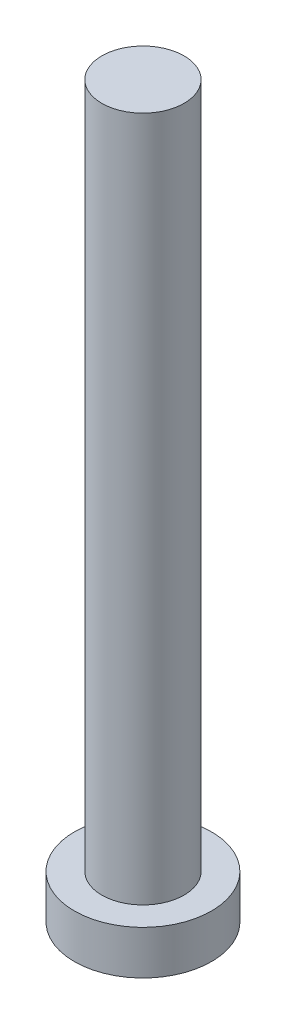
ISO-10303-21;
HEADER;
FILE_DESCRIPTION(('STEP AP214'),'2;1');
FILE_NAME('part.step','',(''),(''),'','','');
FILE_SCHEMA(('AUTOMOTIVE_DESIGN { 1 0 10303 214 1 1 1 1 }'));
ENDSEC;
DATA;
#1=APPLICATION_CONTEXT('core data for automotive mechanical design processes');
#2=APPLICATION_PROTOCOL_DEFINITION('international standard','automotive_design',2000,#1);
#3=PRODUCT_CONTEXT('',#1,'mechanical');
#4=PRODUCT('Part','Part','',(#3));
#5=PRODUCT_RELATED_PRODUCT_CATEGORY('part','',(#4));
#6=PRODUCT_DEFINITION_FORMATION('','',#4);
#7=PRODUCT_DEFINITION_CONTEXT('part definition',#1,'design');
#8=PRODUCT_DEFINITION('design','',#6,#7);
#9=PRODUCT_DEFINITION_SHAPE('','',#8);
#10=(LENGTH_UNIT() NAMED_UNIT(*) SI_UNIT(.MILLI.,.METRE.));
#11=(NAMED_UNIT(*) PLANE_ANGLE_UNIT() SI_UNIT($,.RADIAN.));
#12=(NAMED_UNIT(*) SI_UNIT($,.STERADIAN.) SOLID_ANGLE_UNIT());
#13=UNCERTAINTY_MEASURE_WITH_UNIT(LENGTH_MEASURE(1.E-05),#10,'distance_accuracy_value','');
#14=(GEOMETRIC_REPRESENTATION_CONTEXT(3) GLOBAL_UNCERTAINTY_ASSIGNED_CONTEXT((#13)) GLOBAL_UNIT_ASSIGNED_CONTEXT((#10,
#11,#12)) REPRESENTATION_CONTEXT('',''));
#15=CARTESIAN_POINT('',(0.,0.,0.));
#16=DIRECTION('',(0.,0.,1.));
#17=DIRECTION('',(1.,0.,0.));
#18=AXIS2_PLACEMENT_3D('',#15,#16,#17);
#19=CARTESIAN_POINT('',(0.,0.,0.));
#20=DIRECTION('',(0.,1.,0.));
#21=DIRECTION('',(0.,0.,1.));
#22=AXIS2_PLACEMENT_3D('',#19,#20,#21);
#23=PLANE('',#22);
#24=CARTESIAN_POINT('',(0.,0.,0.));
#25=DIRECTION('',(0.,1.,0.));
#26=DIRECTION('',(0.,0.,1.));
#27=AXIS2_PLACEMENT_3D('',#24,#25,#26);
#28=CIRCLE('',#27,2.5);
#29=CARTESIAN_POINT('',(0.,0.,2.5));
#30=VERTEX_POINT('',#29);
#31=EDGE_CURVE('E39',#30,#30,#28,.T.);
#32=ORIENTED_EDGE('',*,*,#31,.F.);
#33=EDGE_LOOP('',(#32));
#34=FACE_BOUND('',#33,.T.);
#35=CARTESIAN_POINT('',(1.,0.,1.));
#36=DIRECTION('',(0.,1.,0.));
#37=DIRECTION('',(0.,0.,-1.));
#38=AXIS2_PLACEMENT_3D('',#35,#36,#37);
#39=CIRCLE('',#38,0.5);
#40=CARTESIAN_POINT('',(1.,0.,0.5));
#41=VERTEX_POINT('',#40);
#42=CARTESIAN_POINT('',(0.5,0.,1.));
#43=VERTEX_POINT('',#42);
#44=EDGE_CURVE('E186',#41,#43,#39,.T.);
#45=ORIENTED_EDGE('',*,*,#44,.F.);
#46=DIRECTION('',(-1.,0.,0.));
#47=VECTOR('',#46,1.);
#48=CARTESIAN_POINT('',(1.,0.,0.5));
#49=LINE('',#48,#47);
#50=CARTESIAN_POINT('',(1.75,0.,0.5));
#51=VERTEX_POINT('',#50);
#52=EDGE_CURVE('E52',#51,#41,#49,.T.);
#53=ORIENTED_EDGE('',*,*,#52,.F.);
#54=DIRECTION('',(0.,0.,1.));
#55=VECTOR('',#54,1.);
#56=CARTESIAN_POINT('',(1.75,0.,-0.5));
#57=LINE('',#56,#55);
#58=CARTESIAN_POINT('',(1.75,0.,-0.5));
#59=VERTEX_POINT('',#58);
#60=EDGE_CURVE('E225',#59,#51,#57,.T.);
#61=ORIENTED_EDGE('',*,*,#60,.F.);
#62=DIRECTION('',(1.,0.,0.));
#63=VECTOR('',#62,1.);
#64=CARTESIAN_POINT('',(1.,0.,-0.5));
#65=LINE('',#64,#63);
#66=CARTESIAN_POINT('',(1.,0.,-0.5));
#67=VERTEX_POINT('',#66);
#68=EDGE_CURVE('E223',#67,#59,#65,.T.);
#69=ORIENTED_EDGE('',*,*,#68,.F.);
#70=CARTESIAN_POINT('',(1.,0.,-1.));
#71=DIRECTION('',(0.,1.,0.));
#72=DIRECTION('',(0.,0.,-1.));
#73=AXIS2_PLACEMENT_3D('',#70,#71,#72);
#74=CIRCLE('',#73,0.5);
#75=CARTESIAN_POINT('',(0.5,0.,-1.));
#76=VERTEX_POINT('',#75);
#77=EDGE_CURVE('E160',#76,#67,#74,.T.);
#78=ORIENTED_EDGE('',*,*,#77,.F.);
#79=DIRECTION('',(0.,0.,1.));
#80=VECTOR('',#79,1.);
#81=CARTESIAN_POINT('',(0.5,0.,-1.75));
#82=LINE('',#81,#80);
#83=CARTESIAN_POINT('',(0.5,0.,-1.75));
#84=VERTEX_POINT('',#83);
#85=EDGE_CURVE('E219',#84,#76,#82,.T.);
#86=ORIENTED_EDGE('',*,*,#85,.F.);
#87=DIRECTION('',(1.,0.,0.));
#88=VECTOR('',#87,1.);
#89=CARTESIAN_POINT('',(-0.5,0.,-1.75));
#90=LINE('',#89,#88);
#91=CARTESIAN_POINT('',(-0.5,0.,-1.75));
#92=VERTEX_POINT('',#91);
#93=EDGE_CURVE('E216',#92,#84,#90,.T.);
#94=ORIENTED_EDGE('',*,*,#93,.F.);
#95=DIRECTION('',(0.,0.,-1.));
#96=VECTOR('',#95,1.);
#97=CARTESIAN_POINT('',(-0.5,0.,-1.75));
#98=LINE('',#97,#96);
#99=CARTESIAN_POINT('',(-0.5,0.,-1.));
#100=VERTEX_POINT('',#99);
#101=EDGE_CURVE('E213',#100,#92,#98,.T.);
#102=ORIENTED_EDGE('',*,*,#101,.F.);
#103=CARTESIAN_POINT('',(-1.,0.,-1.));
#104=DIRECTION('',(0.,1.,0.));
#105=DIRECTION('',(0.,0.,-1.));
#106=AXIS2_PLACEMENT_3D('',#103,#104,#105);
#107=CIRCLE('',#106,0.5);
#108=CARTESIAN_POINT('',(-1.,0.,-0.5));
#109=VERTEX_POINT('',#108);
#110=EDGE_CURVE('E210',#109,#100,#107,.T.);
#111=ORIENTED_EDGE('',*,*,#110,.F.);
#112=DIRECTION('',(1.,0.,0.));
#113=VECTOR('',#112,1.);
#114=CARTESIAN_POINT('',(-1.75,0.,-0.5));
#115=LINE('',#114,#113);
#116=CARTESIAN_POINT('',(-1.75,0.,-0.5));
#117=VERTEX_POINT('',#116);
#118=EDGE_CURVE('E207',#117,#109,#115,.T.);
#119=ORIENTED_EDGE('',*,*,#118,.F.);
#120=DIRECTION('',(0.,0.,-1.));
#121=VECTOR('',#120,1.);
#122=CARTESIAN_POINT('',(-1.75,0.,-0.5));
#123=LINE('',#122,#121);
#124=CARTESIAN_POINT('',(-1.75,0.,0.5));
#125=VERTEX_POINT('',#124);
#126=EDGE_CURVE('E204',#125,#117,#123,.T.);
#127=ORIENTED_EDGE('',*,*,#126,.F.);
#128=DIRECTION('',(-1.,0.,0.));
#129=VECTOR('',#128,1.);
#130=CARTESIAN_POINT('',(-1.75,0.,0.5));
#131=LINE('',#130,#129);
#132=CARTESIAN_POINT('',(-1.,0.,0.5));
#133=VERTEX_POINT('',#132);
#134=EDGE_CURVE('E201',#133,#125,#131,.T.);
#135=ORIENTED_EDGE('',*,*,#134,.F.);
#136=CARTESIAN_POINT('',(-1.,0.,1.));
#137=DIRECTION('',(0.,1.,0.));
#138=DIRECTION('',(0.,0.,1.));
#139=AXIS2_PLACEMENT_3D('',#136,#137,#138);
#140=CIRCLE('',#139,0.5);
#141=CARTESIAN_POINT('',(-0.5,0.,1.));
#142=VERTEX_POINT('',#141);
#143=EDGE_CURVE('E198',#142,#133,#140,.T.);
#144=ORIENTED_EDGE('',*,*,#143,.F.);
#145=DIRECTION('',(0.,0.,-1.));
#146=VECTOR('',#145,1.);
#147=CARTESIAN_POINT('',(-0.5,0.,1.));
#148=LINE('',#147,#146);
#149=CARTESIAN_POINT('',(-0.5,0.,1.75));
#150=VERTEX_POINT('',#149);
#151=EDGE_CURVE('E195',#150,#142,#148,.T.);
#152=ORIENTED_EDGE('',*,*,#151,.F.);
#153=DIRECTION('',(-1.,0.,0.));
#154=VECTOR('',#153,1.);
#155=CARTESIAN_POINT('',(-0.5,0.,1.75));
#156=LINE('',#155,#154);
#157=CARTESIAN_POINT('',(0.5,0.,1.75));
#158=VERTEX_POINT('',#157);
#159=EDGE_CURVE('E192',#158,#150,#156,.T.);
#160=ORIENTED_EDGE('',*,*,#159,.F.);
#161=DIRECTION('',(0.,0.,1.));
#162=VECTOR('',#161,1.);
#163=CARTESIAN_POINT('',(0.5,0.,1.));
#164=LINE('',#163,#162);
#165=EDGE_CURVE('E189',#43,#158,#164,.T.);
#166=ORIENTED_EDGE('',*,*,#165,.F.);
#167=EDGE_LOOP('',(#45,#53,#61,#69,#78,#86,#94,#102,#111,#119,#127,#135,#144,#152,#160,#166));
#168=FACE_BOUND('',#167,.T.);
#169=ADVANCED_FACE('F35',(#34,#168),#23,.F.);
#170=CARTESIAN_POINT('',(0.,1.6,0.));
#171=DIRECTION('',(0.,-1.,0.));
#172=DIRECTION('',(0.,0.,-1.));
#173=AXIS2_PLACEMENT_3D('',#170,#171,#172);
#174=CYLINDRICAL_SURFACE('',#173,2.5);
#175=CARTESIAN_POINT('',(0.,1.6,0.));
#176=DIRECTION('',(0.,1.,0.));
#177=DIRECTION('',(0.,0.,1.));
#178=AXIS2_PLACEMENT_3D('',#175,#176,#177);
#179=CIRCLE('',#178,2.5);
#180=CARTESIAN_POINT('',(0.,1.6,2.5));
#181=VERTEX_POINT('',#180);
#182=EDGE_CURVE('E44',#181,#181,#179,.T.);
#183=ORIENTED_EDGE('',*,*,#182,.F.);
#184=EDGE_LOOP('',(#183));
#185=FACE_BOUND('',#184,.T.);
#186=ORIENTED_EDGE('',*,*,#31,.T.);
#187=EDGE_LOOP('',(#186));
#188=FACE_BOUND('',#187,.T.);
#189=ADVANCED_FACE('F37',(#185,#188),#174,.T.);
#190=CARTESIAN_POINT('',(0.,1.6,0.));
#191=DIRECTION('',(0.,1.,0.));
#192=DIRECTION('',(0.,0.,1.));
#193=AXIS2_PLACEMENT_3D('',#190,#191,#192);
#194=PLANE('',#193);
#195=CARTESIAN_POINT('',(0.,1.6,0.));
#196=DIRECTION('',(0.,1.,0.));
#197=DIRECTION('',(0.,0.,1.));
#198=AXIS2_PLACEMENT_3D('',#195,#196,#197);
#199=CIRCLE('',#198,1.5);
#200=CARTESIAN_POINT('',(0.,1.6,1.5));
#201=VERTEX_POINT('',#200);
#202=EDGE_CURVE('E11',#201,#201,#199,.T.);
#203=ORIENTED_EDGE('',*,*,#202,.F.);
#204=EDGE_LOOP('',(#203));
#205=FACE_BOUND('',#204,.T.);
#206=ORIENTED_EDGE('',*,*,#182,.T.);
#207=EDGE_LOOP('',(#206));
#208=FACE_BOUND('',#207,.T.);
#209=ADVANCED_FACE('F374',(#205,#208),#194,.T.);
#210=CARTESIAN_POINT('',(0.,26.6,0.));
#211=DIRECTION('',(0.,-1.,0.));
#212=DIRECTION('',(0.,0.,-1.));
#213=AXIS2_PLACEMENT_3D('',#210,#211,#212);
#214=CYLINDRICAL_SURFACE('',#213,1.5);
#215=CARTESIAN_POINT('',(0.,26.6,0.));
#216=DIRECTION('',(0.,1.,0.));
#217=DIRECTION('',(0.,0.,1.));
#218=AXIS2_PLACEMENT_3D('',#215,#216,#217);
#219=CIRCLE('',#218,1.5);
#220=CARTESIAN_POINT('',(0.,26.6,1.5));
#221=VERTEX_POINT('',#220);
#222=EDGE_CURVE('E229',#221,#221,#219,.T.);
#223=ORIENTED_EDGE('',*,*,#222,.F.);
#224=EDGE_LOOP('',(#223));
#225=FACE_BOUND('',#224,.T.);
#226=ORIENTED_EDGE('',*,*,#202,.T.);
#227=EDGE_LOOP('',(#226));
#228=FACE_BOUND('',#227,.T.);
#229=ADVANCED_FACE('F370',(#225,#228),#214,.T.);
#230=CARTESIAN_POINT('',(0.,26.6,0.));
#231=DIRECTION('',(0.,1.,0.));
#232=DIRECTION('',(0.,0.,1.));
#233=AXIS2_PLACEMENT_3D('',#230,#231,#232);
#234=PLANE('',#233);
#235=ORIENTED_EDGE('',*,*,#222,.T.);
#236=EDGE_LOOP('',(#235));
#237=FACE_BOUND('',#236,.T.);
#238=ADVANCED_FACE('F320',(#237),#234,.T.);
#239=CARTESIAN_POINT('',(1.,1.,0.5));
#240=DIRECTION('',(0.,0.,1.));
#241=DIRECTION('',(1.,0.,0.));
#242=AXIS2_PLACEMENT_3D('',#239,#240,#241);
#243=PLANE('',#242);
#244=ORIENTED_EDGE('',*,*,#52,.T.);
#245=DIRECTION('',(0.,-1.,0.));
#246=VECTOR('',#245,1.);
#247=CARTESIAN_POINT('',(1.,1.,0.5));
#248=LINE('',#247,#246);
#249=CARTESIAN_POINT('',(1.,1.,0.5));
#250=VERTEX_POINT('',#249);
#251=EDGE_CURVE('E112',#250,#41,#248,.T.);
#252=ORIENTED_EDGE('',*,*,#251,.F.);
#253=DIRECTION('',(-1.,0.,0.));
#254=VECTOR('',#253,1.);
#255=CARTESIAN_POINT('',(1.,1.,0.5));
#256=LINE('',#255,#254);
#257=CARTESIAN_POINT('',(1.75,1.,0.5));
#258=VERTEX_POINT('',#257);
#259=EDGE_CURVE('E227',#258,#250,#256,.T.);
#260=ORIENTED_EDGE('',*,*,#259,.F.);
#261=DIRECTION('',(0.,-1.,0.));
#262=VECTOR('',#261,1.);
#263=CARTESIAN_POINT('',(1.75,1.,0.5));
#264=LINE('',#263,#262);
#265=EDGE_CURVE('E60',#258,#51,#264,.T.);
#266=ORIENTED_EDGE('',*,*,#265,.T.);
#267=EDGE_LOOP('',(#244,#252,#260,#266));
#268=FACE_BOUND('',#267,.T.);
#269=ADVANCED_FACE('F313',(#268),#243,.F.);
#270=CARTESIAN_POINT('',(1.75,1.,-0.5));
#271=DIRECTION('',(1.,0.,0.));
#272=DIRECTION('',(0.,0.,-1.));
#273=AXIS2_PLACEMENT_3D('',#270,#271,#272);
#274=PLANE('',#273);
#275=ORIENTED_EDGE('',*,*,#60,.T.);
#276=ORIENTED_EDGE('',*,*,#265,.F.);
#277=DIRECTION('',(0.,0.,1.));
#278=VECTOR('',#277,1.);
#279=CARTESIAN_POINT('',(1.75,1.,-0.5));
#280=LINE('',#279,#278);
#281=CARTESIAN_POINT('',(1.75,1.,-0.5));
#282=VERTEX_POINT('',#281);
#283=EDGE_CURVE('E172',#282,#258,#280,.T.);
#284=ORIENTED_EDGE('',*,*,#283,.F.);
#285=DIRECTION('',(0.,-1.,0.));
#286=VECTOR('',#285,1.);
#287=CARTESIAN_POINT('',(1.75,1.,-0.5));
#288=LINE('',#287,#286);
#289=EDGE_CURVE('E164',#282,#59,#288,.T.);
#290=ORIENTED_EDGE('',*,*,#289,.T.);
#291=EDGE_LOOP('',(#275,#276,#284,#290));
#292=FACE_BOUND('',#291,.T.);
#293=ADVANCED_FACE('F311',(#292),#274,.F.);
#294=CARTESIAN_POINT('',(1.,1.,-0.5));
#295=DIRECTION('',(0.,0.,-1.));
#296=DIRECTION('',(-1.,0.,0.));
#297=AXIS2_PLACEMENT_3D('',#294,#295,#296);
#298=PLANE('',#297);
#299=ORIENTED_EDGE('',*,*,#68,.T.);
#300=ORIENTED_EDGE('',*,*,#289,.F.);
#301=DIRECTION('',(1.,0.,0.));
#302=VECTOR('',#301,1.);
#303=CARTESIAN_POINT('',(1.,1.,-0.5));
#304=LINE('',#303,#302);
#305=CARTESIAN_POINT('',(1.,1.,-0.5));
#306=VERTEX_POINT('',#305);
#307=EDGE_CURVE('E168',#306,#282,#304,.T.);
#308=ORIENTED_EDGE('',*,*,#307,.F.);
#309=DIRECTION('',(0.,-1.,0.));
#310=VECTOR('',#309,1.);
#311=CARTESIAN_POINT('',(1.,1.,-0.5));
#312=LINE('',#311,#310);
#313=EDGE_CURVE('E153',#306,#67,#312,.T.);
#314=ORIENTED_EDGE('',*,*,#313,.T.);
#315=EDGE_LOOP('',(#299,#300,#308,#314));
#316=FACE_BOUND('',#315,.T.);
#317=ADVANCED_FACE('F169',(#316),#298,.F.);
#318=CARTESIAN_POINT('',(1.,1.,-1.));
#319=DIRECTION('',(0.,-1.,0.));
#320=DIRECTION('',(0.,0.,-1.));
#321=AXIS2_PLACEMENT_3D('',#318,#319,#320);
#322=CYLINDRICAL_SURFACE('',#321,0.5);
#323=ORIENTED_EDGE('',*,*,#77,.T.);
#324=ORIENTED_EDGE('',*,*,#313,.F.);
#325=CARTESIAN_POINT('',(1.,1.,-1.));
#326=DIRECTION('',(0.,1.,0.));
#327=DIRECTION('',(0.,0.,-1.));
#328=AXIS2_PLACEMENT_3D('',#325,#326,#327);
#329=CIRCLE('',#328,0.5);
#330=CARTESIAN_POINT('',(0.5,1.,-1.));
#331=VERTEX_POINT('',#330);
#332=EDGE_CURVE('E157',#331,#306,#329,.T.);
#333=ORIENTED_EDGE('',*,*,#332,.F.);
#334=DIRECTION('',(0.,-1.,0.));
#335=VECTOR('',#334,1.);
#336=CARTESIAN_POINT('',(0.5,1.,-1.));
#337=LINE('',#336,#335);
#338=EDGE_CURVE('E165',#331,#76,#337,.T.);
#339=ORIENTED_EDGE('',*,*,#338,.T.);
#340=EDGE_LOOP('',(#323,#324,#333,#339));
#341=FACE_BOUND('',#340,.T.);
#342=ADVANCED_FACE('F155',(#341),#322,.T.);
#343=CARTESIAN_POINT('',(0.5,1.,-1.75));
#344=DIRECTION('',(1.,0.,0.));
#345=DIRECTION('',(0.,0.,-1.));
#346=AXIS2_PLACEMENT_3D('',#343,#344,#345);
#347=PLANE('',#346);
#348=ORIENTED_EDGE('',*,*,#85,.T.);
#349=ORIENTED_EDGE('',*,*,#338,.F.);
#350=DIRECTION('',(0.,0.,1.));
#351=VECTOR('',#350,1.);
#352=CARTESIAN_POINT('',(0.5,1.,-1.75));
#353=LINE('',#352,#351);
#354=CARTESIAN_POINT('',(0.5,1.,-1.75));
#355=VERTEX_POINT('',#354);
#356=EDGE_CURVE('E178',#355,#331,#353,.T.);
#357=ORIENTED_EDGE('',*,*,#356,.F.);
#358=DIRECTION('',(0.,-1.,0.));
#359=VECTOR('',#358,1.);
#360=CARTESIAN_POINT('',(0.5,1.,-1.75));
#361=LINE('',#360,#359);
#362=EDGE_CURVE('E232',#355,#84,#361,.T.);
#363=ORIENTED_EDGE('',*,*,#362,.T.);
#364=EDGE_LOOP('',(#348,#349,#357,#363));
#365=FACE_BOUND('',#364,.T.);
#366=ADVANCED_FACE('F310',(#365),#347,.F.);
#367=CARTESIAN_POINT('',(-0.5,1.,-1.75));
#368=DIRECTION('',(0.,0.,-1.));
#369=DIRECTION('',(-1.,0.,0.));
#370=AXIS2_PLACEMENT_3D('',#367,#368,#369);
#371=PLANE('',#370);
#372=ORIENTED_EDGE('',*,*,#93,.T.);
#373=ORIENTED_EDGE('',*,*,#362,.F.);
#374=DIRECTION('',(1.,0.,0.));
#375=VECTOR('',#374,1.);
#376=CARTESIAN_POINT('',(-0.5,1.,-1.75));
#377=LINE('',#376,#375);
#378=CARTESIAN_POINT('',(-0.5,1.,-1.75));
#379=VERTEX_POINT('',#378);
#380=EDGE_CURVE('E180',#379,#355,#377,.T.);
#381=ORIENTED_EDGE('',*,*,#380,.F.);
#382=DIRECTION('',(0.,-1.,0.));
#383=VECTOR('',#382,1.);
#384=CARTESIAN_POINT('',(-0.5,1.,-1.75));
#385=LINE('',#384,#383);
#386=EDGE_CURVE('E234',#379,#92,#385,.T.);
#387=ORIENTED_EDGE('',*,*,#386,.T.);
#388=EDGE_LOOP('',(#372,#373,#381,#387));
#389=FACE_BOUND('',#388,.T.);
#390=ADVANCED_FACE('F306',(#389),#371,.F.);
#391=CARTESIAN_POINT('',(-0.5,1.,-1.75));
#392=DIRECTION('',(-1.,0.,0.));
#393=DIRECTION('',(0.,0.,1.));
#394=AXIS2_PLACEMENT_3D('',#391,#392,#393);
#395=PLANE('',#394);
#396=ORIENTED_EDGE('',*,*,#101,.T.);
#397=ORIENTED_EDGE('',*,*,#386,.F.);
#398=DIRECTION('',(0.,0.,-1.));
#399=VECTOR('',#398,1.);
#400=CARTESIAN_POINT('',(-0.5,1.,-1.75));
#401=LINE('',#400,#399);
#402=CARTESIAN_POINT('',(-0.5,1.,-1.));
#403=VERTEX_POINT('',#402);
#404=EDGE_CURVE('E301',#403,#379,#401,.T.);
#405=ORIENTED_EDGE('',*,*,#404,.F.);
#406=DIRECTION('',(0.,-1.,0.));
#407=VECTOR('',#406,1.);
#408=CARTESIAN_POINT('',(-0.5,1.,-1.));
#409=LINE('',#408,#407);
#410=EDGE_CURVE('E236',#403,#100,#409,.T.);
#411=ORIENTED_EDGE('',*,*,#410,.T.);
#412=EDGE_LOOP('',(#396,#397,#405,#411));
#413=FACE_BOUND('',#412,.T.);
#414=ADVANCED_FACE('F330',(#413),#395,.F.);
#415=CARTESIAN_POINT('',(-1.,1.,-1.));
#416=DIRECTION('',(0.,-1.,0.));
#417=DIRECTION('',(0.,0.,-1.));
#418=AXIS2_PLACEMENT_3D('',#415,#416,#417);
#419=CYLINDRICAL_SURFACE('',#418,0.5);
#420=ORIENTED_EDGE('',*,*,#110,.T.);
#421=ORIENTED_EDGE('',*,*,#410,.F.);
#422=CARTESIAN_POINT('',(-1.,1.,-1.));
#423=DIRECTION('',(0.,1.,0.));
#424=DIRECTION('',(0.,0.,-1.));
#425=AXIS2_PLACEMENT_3D('',#422,#423,#424);
#426=CIRCLE('',#425,0.5);
#427=CARTESIAN_POINT('',(-1.,1.,-0.5));
#428=VERTEX_POINT('',#427);
#429=EDGE_CURVE('E298',#428,#403,#426,.T.);
#430=ORIENTED_EDGE('',*,*,#429,.F.);
#431=DIRECTION('',(0.,-1.,0.));
#432=VECTOR('',#431,1.);
#433=CARTESIAN_POINT('',(-1.,1.,-0.5));
#434=LINE('',#433,#432);
#435=EDGE_CURVE('E238',#428,#109,#434,.T.);
#436=ORIENTED_EDGE('',*,*,#435,.T.);
#437=EDGE_LOOP('',(#420,#421,#430,#436));
#438=FACE_BOUND('',#437,.T.);
#439=ADVANCED_FACE('F333',(#438),#419,.T.);
#440=CARTESIAN_POINT('',(-1.75,1.,-0.5));
#441=DIRECTION('',(0.,0.,-1.));
#442=DIRECTION('',(-1.,0.,0.));
#443=AXIS2_PLACEMENT_3D('',#440,#441,#442);
#444=PLANE('',#443);
#445=ORIENTED_EDGE('',*,*,#118,.T.);
#446=ORIENTED_EDGE('',*,*,#435,.F.);
#447=DIRECTION('',(1.,0.,0.));
#448=VECTOR('',#447,1.);
#449=CARTESIAN_POINT('',(-1.75,1.,-0.5));
#450=LINE('',#449,#448);
#451=CARTESIAN_POINT('',(-1.75,1.,-0.5));
#452=VERTEX_POINT('',#451);
#453=EDGE_CURVE('E295',#452,#428,#450,.T.);
#454=ORIENTED_EDGE('',*,*,#453,.F.);
#455=DIRECTION('',(0.,-1.,0.));
#456=VECTOR('',#455,1.);
#457=CARTESIAN_POINT('',(-1.75,1.,-0.5));
#458=LINE('',#457,#456);
#459=EDGE_CURVE('E240',#452,#117,#458,.T.);
#460=ORIENTED_EDGE('',*,*,#459,.T.);
#461=EDGE_LOOP('',(#445,#446,#454,#460));
#462=FACE_BOUND('',#461,.T.);
#463=ADVANCED_FACE('F337',(#462),#444,.F.);
#464=CARTESIAN_POINT('',(-1.75,1.,-0.5));
#465=DIRECTION('',(-1.,0.,0.));
#466=DIRECTION('',(0.,0.,1.));
#467=AXIS2_PLACEMENT_3D('',#464,#465,#466);
#468=PLANE('',#467);
#469=ORIENTED_EDGE('',*,*,#126,.T.);
#470=ORIENTED_EDGE('',*,*,#459,.F.);
#471=DIRECTION('',(0.,0.,-1.));
#472=VECTOR('',#471,1.);
#473=CARTESIAN_POINT('',(-1.75,1.,-0.5));
#474=LINE('',#473,#472);
#475=CARTESIAN_POINT('',(-1.75,1.,0.5));
#476=VERTEX_POINT('',#475);
#477=EDGE_CURVE('E292',#476,#452,#474,.T.);
#478=ORIENTED_EDGE('',*,*,#477,.F.);
#479=DIRECTION('',(0.,-1.,0.));
#480=VECTOR('',#479,1.);
#481=CARTESIAN_POINT('',(-1.75,1.,0.5));
#482=LINE('',#481,#480);
#483=EDGE_CURVE('E242',#476,#125,#482,.T.);
#484=ORIENTED_EDGE('',*,*,#483,.T.);
#485=EDGE_LOOP('',(#469,#470,#478,#484));
#486=FACE_BOUND('',#485,.T.);
#487=ADVANCED_FACE('F341',(#486),#468,.F.);
#488=CARTESIAN_POINT('',(-1.75,1.,0.5));
#489=DIRECTION('',(0.,0.,1.));
#490=DIRECTION('',(1.,0.,0.));
#491=AXIS2_PLACEMENT_3D('',#488,#489,#490);
#492=PLANE('',#491);
#493=ORIENTED_EDGE('',*,*,#134,.T.);
#494=ORIENTED_EDGE('',*,*,#483,.F.);
#495=DIRECTION('',(-1.,0.,0.));
#496=VECTOR('',#495,1.);
#497=CARTESIAN_POINT('',(-1.75,1.,0.5));
#498=LINE('',#497,#496);
#499=CARTESIAN_POINT('',(-1.,1.,0.5));
#500=VERTEX_POINT('',#499);
#501=EDGE_CURVE('E289',#500,#476,#498,.T.);
#502=ORIENTED_EDGE('',*,*,#501,.F.);
#503=DIRECTION('',(0.,-1.,0.));
#504=VECTOR('',#503,1.);
#505=CARTESIAN_POINT('',(-1.,1.,0.5));
#506=LINE('',#505,#504);
#507=EDGE_CURVE('E244',#500,#133,#506,.T.);
#508=ORIENTED_EDGE('',*,*,#507,.T.);
#509=EDGE_LOOP('',(#493,#494,#502,#508));
#510=FACE_BOUND('',#509,.T.);
#511=ADVANCED_FACE('F345',(#510),#492,.F.);
#512=CARTESIAN_POINT('',(-1.,1.,1.));
#513=DIRECTION('',(0.,-1.,0.));
#514=DIRECTION('',(0.,0.,-1.));
#515=AXIS2_PLACEMENT_3D('',#512,#513,#514);
#516=CYLINDRICAL_SURFACE('',#515,0.5);
#517=ORIENTED_EDGE('',*,*,#143,.T.);
#518=ORIENTED_EDGE('',*,*,#507,.F.);
#519=CARTESIAN_POINT('',(-1.,1.,1.));
#520=DIRECTION('',(0.,1.,0.));
#521=DIRECTION('',(0.,0.,1.));
#522=AXIS2_PLACEMENT_3D('',#519,#520,#521);
#523=CIRCLE('',#522,0.5);
#524=CARTESIAN_POINT('',(-0.5,1.,1.));
#525=VERTEX_POINT('',#524);
#526=EDGE_CURVE('E286',#525,#500,#523,.T.);
#527=ORIENTED_EDGE('',*,*,#526,.F.);
#528=DIRECTION('',(0.,-1.,0.));
#529=VECTOR('',#528,1.);
#530=CARTESIAN_POINT('',(-0.5,1.,1.));
#531=LINE('',#530,#529);
#532=EDGE_CURVE('E246',#525,#142,#531,.T.);
#533=ORIENTED_EDGE('',*,*,#532,.T.);
#534=EDGE_LOOP('',(#517,#518,#527,#533));
#535=FACE_BOUND('',#534,.T.);
#536=ADVANCED_FACE('F349',(#535),#516,.T.);
#537=CARTESIAN_POINT('',(-0.5,1.,1.));
#538=DIRECTION('',(-1.,0.,0.));
#539=DIRECTION('',(0.,0.,1.));
#540=AXIS2_PLACEMENT_3D('',#537,#538,#539);
#541=PLANE('',#540);
#542=ORIENTED_EDGE('',*,*,#151,.T.);
#543=ORIENTED_EDGE('',*,*,#532,.F.);
#544=DIRECTION('',(0.,0.,-1.));
#545=VECTOR('',#544,1.);
#546=CARTESIAN_POINT('',(-0.5,1.,1.));
#547=LINE('',#546,#545);
#548=CARTESIAN_POINT('',(-0.5,1.,1.75));
#549=VERTEX_POINT('',#548);
#550=EDGE_CURVE('E283',#549,#525,#547,.T.);
#551=ORIENTED_EDGE('',*,*,#550,.F.);
#552=DIRECTION('',(0.,-1.,0.));
#553=VECTOR('',#552,1.);
#554=CARTESIAN_POINT('',(-0.5,1.,1.75));
#555=LINE('',#554,#553);
#556=EDGE_CURVE('E248',#549,#150,#555,.T.);
#557=ORIENTED_EDGE('',*,*,#556,.T.);
#558=EDGE_LOOP('',(#542,#543,#551,#557));
#559=FACE_BOUND('',#558,.T.);
#560=ADVANCED_FACE('F353',(#559),#541,.F.);
#561=CARTESIAN_POINT('',(-0.5,1.,1.75));
#562=DIRECTION('',(0.,0.,1.));
#563=DIRECTION('',(1.,0.,0.));
#564=AXIS2_PLACEMENT_3D('',#561,#562,#563);
#565=PLANE('',#564);
#566=ORIENTED_EDGE('',*,*,#159,.T.);
#567=ORIENTED_EDGE('',*,*,#556,.F.);
#568=DIRECTION('',(-1.,0.,0.));
#569=VECTOR('',#568,1.);
#570=CARTESIAN_POINT('',(-0.5,1.,1.75));
#571=LINE('',#570,#569);
#572=CARTESIAN_POINT('',(0.5,1.,1.75));
#573=VERTEX_POINT('',#572);
#574=EDGE_CURVE('E280',#573,#549,#571,.T.);
#575=ORIENTED_EDGE('',*,*,#574,.F.);
#576=DIRECTION('',(0.,-1.,0.));
#577=VECTOR('',#576,1.);
#578=CARTESIAN_POINT('',(0.5,1.,1.75));
#579=LINE('',#578,#577);
#580=EDGE_CURVE('E250',#573,#158,#579,.T.);
#581=ORIENTED_EDGE('',*,*,#580,.T.);
#582=EDGE_LOOP('',(#566,#567,#575,#581));
#583=FACE_BOUND('',#582,.T.);
#584=ADVANCED_FACE('F357',(#583),#565,.F.);
#585=CARTESIAN_POINT('',(0.5,1.,1.));
#586=DIRECTION('',(1.,0.,0.));
#587=DIRECTION('',(0.,0.,-1.));
#588=AXIS2_PLACEMENT_3D('',#585,#586,#587);
#589=PLANE('',#588);
#590=ORIENTED_EDGE('',*,*,#165,.T.);
#591=ORIENTED_EDGE('',*,*,#580,.F.);
#592=DIRECTION('',(0.,0.,1.));
#593=VECTOR('',#592,1.);
#594=CARTESIAN_POINT('',(0.5,1.,1.));
#595=LINE('',#594,#593);
#596=CARTESIAN_POINT('',(0.5,1.,1.));
#597=VERTEX_POINT('',#596);
#598=EDGE_CURVE('E275',#597,#573,#595,.T.);
#599=ORIENTED_EDGE('',*,*,#598,.F.);
#600=DIRECTION('',(0.,-1.,0.));
#601=VECTOR('',#600,1.);
#602=CARTESIAN_POINT('',(0.5,1.,1.));
#603=LINE('',#602,#601);
#604=EDGE_CURVE('E252',#597,#43,#603,.T.);
#605=ORIENTED_EDGE('',*,*,#604,.T.);
#606=EDGE_LOOP('',(#590,#591,#599,#605));
#607=FACE_BOUND('',#606,.T.);
#608=ADVANCED_FACE('F361',(#607),#589,.F.);
#609=CARTESIAN_POINT('',(1.,1.,1.));
#610=DIRECTION('',(0.,-1.,0.));
#611=DIRECTION('',(0.,0.,-1.));
#612=AXIS2_PLACEMENT_3D('',#609,#610,#611);
#613=CYLINDRICAL_SURFACE('',#612,0.5);
#614=ORIENTED_EDGE('',*,*,#44,.T.);
#615=ORIENTED_EDGE('',*,*,#604,.F.);
#616=CARTESIAN_POINT('',(1.,1.,1.));
#617=DIRECTION('',(0.,1.,0.));
#618=DIRECTION('',(0.,0.,-1.));
#619=AXIS2_PLACEMENT_3D('',#616,#617,#618);
#620=CIRCLE('',#619,0.5);
#621=EDGE_CURVE('E273',#250,#597,#620,.T.);
#622=ORIENTED_EDGE('',*,*,#621,.F.);
#623=ORIENTED_EDGE('',*,*,#251,.T.);
#624=EDGE_LOOP('',(#614,#615,#622,#623));
#625=FACE_BOUND('',#624,.T.);
#626=ADVANCED_FACE('F270',(#625),#613,.T.);
#627=CARTESIAN_POINT('',(1.,1.,-1.));
#628=DIRECTION('',(0.,-1.,0.));
#629=DIRECTION('',(0.,0.,-1.));
#630=AXIS2_PLACEMENT_3D('',#627,#628,#629);
#631=PLANE('',#630);
#632=ORIENTED_EDGE('',*,*,#259,.T.);
#633=ORIENTED_EDGE('',*,*,#621,.T.);
#634=ORIENTED_EDGE('',*,*,#598,.T.);
#635=ORIENTED_EDGE('',*,*,#574,.T.);
#636=ORIENTED_EDGE('',*,*,#550,.T.);
#637=ORIENTED_EDGE('',*,*,#526,.T.);
#638=ORIENTED_EDGE('',*,*,#501,.T.);
#639=ORIENTED_EDGE('',*,*,#477,.T.);
#640=ORIENTED_EDGE('',*,*,#453,.T.);
#641=ORIENTED_EDGE('',*,*,#429,.T.);
#642=ORIENTED_EDGE('',*,*,#404,.T.);
#643=ORIENTED_EDGE('',*,*,#380,.T.);
#644=ORIENTED_EDGE('',*,*,#356,.T.);
#645=ORIENTED_EDGE('',*,*,#332,.T.);
#646=ORIENTED_EDGE('',*,*,#307,.T.);
#647=ORIENTED_EDGE('',*,*,#283,.T.);
#648=EDGE_LOOP('',(#632,#633,#634,#635,#636,#637,#638,#639,#640,#641,#642,#643,#644,#645,#646,#647));
#649=FACE_BOUND('',#648,.T.);
#650=ADVANCED_FACE('F175',(#649),#631,.T.);
#651=CLOSED_SHELL('',(#169,#189,#209,#229,#238,#269,#293,#317,#342,#366,#390,#414,#439,#463,
#487,#511,#536,#560,#584,#608,#626,#650));
#652=MANIFOLD_SOLID_BREP('B2',#651);
#653=ADVANCED_BREP_SHAPE_REPRESENTATION('',(#18,#652),#14);
#654=SHAPE_DEFINITION_REPRESENTATION(#9,#653);
ENDSEC;
END-ISO-10303-21;
